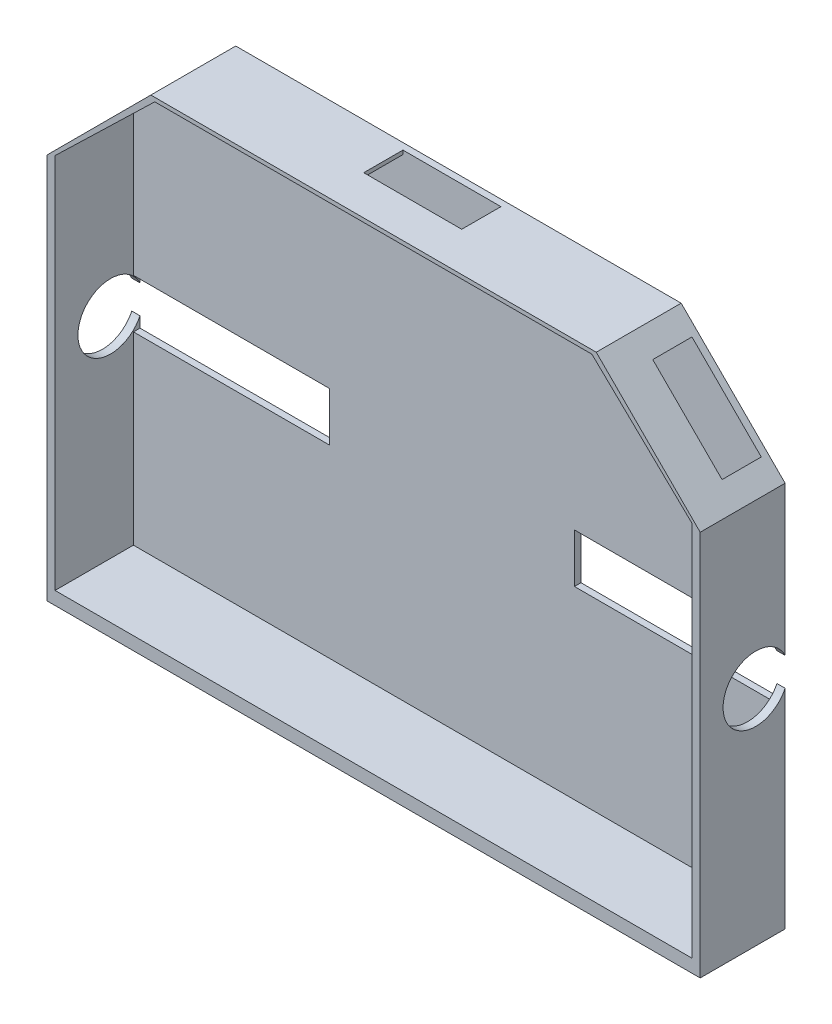
ISO-10303-21;
HEADER;
FILE_DESCRIPTION(('STEP AP214'),'2;1');
FILE_NAME('part.step','',(''),(''),'','','');
FILE_SCHEMA(('AUTOMOTIVE_DESIGN { 1 0 10303 214 1 1 1 1 }'));
ENDSEC;
DATA;
#1=APPLICATION_CONTEXT('core data for automotive mechanical design processes');
#2=APPLICATION_PROTOCOL_DEFINITION('international standard','automotive_design',2000,#1);
#3=PRODUCT_CONTEXT('',#1,'mechanical');
#4=PRODUCT('Part','Part','',(#3));
#5=PRODUCT_RELATED_PRODUCT_CATEGORY('part','',(#4));
#6=PRODUCT_DEFINITION_FORMATION('','',#4);
#7=PRODUCT_DEFINITION_CONTEXT('part definition',#1,'design');
#8=PRODUCT_DEFINITION('design','',#6,#7);
#9=PRODUCT_DEFINITION_SHAPE('','',#8);
#10=(LENGTH_UNIT() NAMED_UNIT(*) SI_UNIT(.MILLI.,.METRE.));
#11=(NAMED_UNIT(*) PLANE_ANGLE_UNIT() SI_UNIT($,.RADIAN.));
#12=(NAMED_UNIT(*) SI_UNIT($,.STERADIAN.) SOLID_ANGLE_UNIT());
#13=UNCERTAINTY_MEASURE_WITH_UNIT(LENGTH_MEASURE(1.E-05),#10,'distance_accuracy_value','');
#14=(GEOMETRIC_REPRESENTATION_CONTEXT(3) GLOBAL_UNCERTAINTY_ASSIGNED_CONTEXT((#13)) GLOBAL_UNIT_ASSIGNED_CONTEXT((#10,
#11,#12)) REPRESENTATION_CONTEXT('',''));
#15=CARTESIAN_POINT('',(0.,0.,0.));
#16=DIRECTION('',(0.,0.,1.));
#17=DIRECTION('',(1.,0.,0.));
#18=AXIS2_PLACEMENT_3D('',#15,#16,#17);
#19=CARTESIAN_POINT('',(200.,-0.01000000000001,52.));
#20=DIRECTION('',(0.,0.,-1.));
#21=DIRECTION('',(-1.,0.,0.));
#22=AXIS2_PLACEMENT_3D('',#19,#20,#21);
#23=PLANE('',#22);
#24=DIRECTION('',(0.,1.,0.));
#25=VECTOR('',#24,1.);
#26=CARTESIAN_POINT('',(2.49999999999999,65.,52.));
#27=LINE('',#26,#25);
#28=CARTESIAN_POINT('',(2.50000000000001,60.5483624870029,52.));
#29=VERTEX_POINT('',#28);
#30=CARTESIAN_POINT('',(2.50000000000001,63.8212959030645,52.));
#31=VERTEX_POINT('',#30);
#32=EDGE_CURVE('E371',#29,#31,#27,.T.);
#33=ORIENTED_EDGE('',*,*,#32,.F.);
#34=DIRECTION('',(1.,0.,0.));
#35=VECTOR('',#34,1.);
#36=CARTESIAN_POINT('',(62.5,60.5483624870029,52.));
#37=LINE('',#36,#35);
#38=CARTESIAN_POINT('',(62.5,60.5483624870029,52.));
#39=VERTEX_POINT('',#38);
#40=EDGE_CURVE('E521',#29,#39,#37,.T.);
#41=ORIENTED_EDGE('',*,*,#40,.T.);
#42=DIRECTION('',(0.,1.,0.));
#43=VECTOR('',#42,1.);
#44=CARTESIAN_POINT('',(62.5,75.5483624870029,52.));
#45=LINE('',#44,#43);
#46=CARTESIAN_POINT('',(62.5,75.5483624870029,52.));
#47=VERTEX_POINT('',#46);
#48=EDGE_CURVE('E524',#39,#47,#45,.T.);
#49=ORIENTED_EDGE('',*,*,#48,.T.);
#50=DIRECTION('',(-1.,0.,0.));
#51=VECTOR('',#50,1.);
#52=CARTESIAN_POINT('',(2.50000000000002,75.5483624870029,52.));
#53=LINE('',#52,#51);
#54=CARTESIAN_POINT('',(2.50000000000002,75.5483624870029,52.));
#55=VERTEX_POINT('',#54);
#56=EDGE_CURVE('E296',#47,#55,#53,.T.);
#57=ORIENTED_EDGE('',*,*,#56,.T.);
#58=CARTESIAN_POINT('',(2.49999999999999,72.5390937901459,52.));
#59=VERTEX_POINT('',#58);
#60=EDGE_CURVE('E373',#59,#55,#27,.T.);
#61=ORIENTED_EDGE('',*,*,#60,.F.);
#62=DIRECTION('',(1.,0.,0.));
#63=VECTOR('',#62,1.);
#64=CARTESIAN_POINT('',(0.,72.5390937901459,52.));
#65=LINE('',#64,#63);
#66=CARTESIAN_POINT('',(0.,72.5390937901459,52.));
#67=VERTEX_POINT('',#66);
#68=EDGE_CURVE('E390',#59,#67,#65,.F.);
#69=ORIENTED_EDGE('',*,*,#68,.T.);
#70=DIRECTION('',(0.,-1.,0.));
#71=VECTOR('',#70,1.);
#72=CARTESIAN_POINT('',(0.,0.,52.));
#73=LINE('',#72,#71);
#74=CARTESIAN_POINT('',(0.,118.180194846605,52.));
#75=VERTEX_POINT('',#74);
#76=EDGE_CURVE('E379',#75,#67,#73,.T.);
#77=ORIENTED_EDGE('',*,*,#76,.F.);
#78=DIRECTION('',(-0.707106781186551,-0.707106781186544,0.));
#79=VECTOR('',#78,1.);
#80=CARTESIAN_POINT('',(-59.0900974233027,59.0900974233033,52.));
#81=LINE('',#80,#79);
#82=CARTESIAN_POINT('',(31.819805153395,150.,52.));
#83=VERTEX_POINT('',#82);
#84=EDGE_CURVE('E367',#83,#75,#81,.T.);
#85=ORIENTED_EDGE('',*,*,#84,.F.);
#86=DIRECTION('',(-1.,0.,0.));
#87=VECTOR('',#86,1.);
#88=CARTESIAN_POINT('',(0.,150.,52.));
#89=LINE('',#88,#87);
#90=CARTESIAN_POINT('',(168.180194846606,150.,52.));
#91=VERTEX_POINT('',#90);
#92=EDGE_CURVE('E380',#91,#83,#89,.T.);
#93=ORIENTED_EDGE('',*,*,#92,.F.);
#94=DIRECTION('',(0.707106781186543,-0.707106781186552,0.));
#95=VECTOR('',#94,1.);
#96=CARTESIAN_POINT('',(159.090097423304,159.090097423302,52.));
#97=LINE('',#96,#95);
#98=CARTESIAN_POINT('',(200.,118.180194846605,52.));
#99=VERTEX_POINT('',#98);
#100=EDGE_CURVE('E402',#91,#99,#97,.T.);
#101=ORIENTED_EDGE('',*,*,#100,.T.);
#102=DIRECTION('',(0.,-1.,0.));
#103=VECTOR('',#102,1.);
#104=CARTESIAN_POINT('',(200.,0.,52.));
#105=LINE('',#104,#103);
#106=CARTESIAN_POINT('',(200.,72.5390937901459,52.));
#107=VERTEX_POINT('',#106);
#108=EDGE_CURVE('E386',#99,#107,#105,.T.);
#109=ORIENTED_EDGE('',*,*,#108,.T.);
#110=DIRECTION('',(1.,0.,0.));
#111=VECTOR('',#110,1.);
#112=CARTESIAN_POINT('',(0.,72.5390937901459,52.));
#113=LINE('',#112,#111);
#114=CARTESIAN_POINT('',(197.5,72.5390937901459,52.));
#115=VERTEX_POINT('',#114);
#116=EDGE_CURVE('E396',#107,#115,#113,.F.);
#117=ORIENTED_EDGE('',*,*,#116,.T.);
#118=DIRECTION('',(0.,-1.,0.));
#119=VECTOR('',#118,1.);
#120=CARTESIAN_POINT('',(197.5,67.5,52.));
#121=LINE('',#120,#119);
#122=CARTESIAN_POINT('',(197.5,75.5483624870029,52.));
#123=VERTEX_POINT('',#122);
#124=EDGE_CURVE('E375',#123,#115,#121,.T.);
#125=ORIENTED_EDGE('',*,*,#124,.F.);
#126=DIRECTION('',(-1.,0.,0.));
#127=VECTOR('',#126,1.);
#128=CARTESIAN_POINT('',(197.5,75.5483624870029,52.));
#129=LINE('',#128,#127);
#130=CARTESIAN_POINT('',(137.5,75.5483624870029,52.));
#131=VERTEX_POINT('',#130);
#132=EDGE_CURVE('E516',#123,#131,#129,.T.);
#133=ORIENTED_EDGE('',*,*,#132,.T.);
#134=DIRECTION('',(0.,-1.,0.));
#135=VECTOR('',#134,1.);
#136=CARTESIAN_POINT('',(137.5,75.5483624870029,52.));
#137=LINE('',#136,#135);
#138=CARTESIAN_POINT('',(137.5,60.5483624870029,52.));
#139=VERTEX_POINT('',#138);
#140=EDGE_CURVE('E518',#131,#139,#137,.T.);
#141=ORIENTED_EDGE('',*,*,#140,.T.);
#142=DIRECTION('',(1.,0.,0.));
#143=VECTOR('',#142,1.);
#144=CARTESIAN_POINT('',(137.5,60.5483624870029,52.));
#145=LINE('',#144,#143);
#146=CARTESIAN_POINT('',(197.5,60.5483624870029,52.));
#147=VERTEX_POINT('',#146);
#148=EDGE_CURVE('E437',#139,#147,#145,.T.);
#149=ORIENTED_EDGE('',*,*,#148,.T.);
#150=CARTESIAN_POINT('',(197.5,63.8212959030645,52.));
#151=VERTEX_POINT('',#150);
#152=EDGE_CURVE('E374',#151,#147,#121,.T.);
#153=ORIENTED_EDGE('',*,*,#152,.F.);
#154=DIRECTION('',(1.,0.,0.));
#155=VECTOR('',#154,1.);
#156=CARTESIAN_POINT('',(0.,63.8212959030645,52.));
#157=LINE('',#156,#155);
#158=CARTESIAN_POINT('',(200.,63.8212959030645,52.));
#159=VERTEX_POINT('',#158);
#160=EDGE_CURVE('E399',#151,#159,#157,.T.);
#161=ORIENTED_EDGE('',*,*,#160,.T.);
#162=CARTESIAN_POINT('',(200.,0.,52.));
#163=VERTEX_POINT('',#162);
#164=EDGE_CURVE('E387',#159,#163,#105,.T.);
#165=ORIENTED_EDGE('',*,*,#164,.T.);
#166=DIRECTION('',(-1.,0.,0.));
#167=VECTOR('',#166,1.);
#168=CARTESIAN_POINT('',(0.,0.,52.));
#169=LINE('',#168,#167);
#170=CARTESIAN_POINT('',(0.,0.,52.));
#171=VERTEX_POINT('',#170);
#172=EDGE_CURVE('E383',#163,#171,#169,.T.);
#173=ORIENTED_EDGE('',*,*,#172,.T.);
#174=CARTESIAN_POINT('',(0.,63.8212959030645,52.));
#175=VERTEX_POINT('',#174);
#176=EDGE_CURVE('E377',#175,#171,#73,.T.);
#177=ORIENTED_EDGE('',*,*,#176,.F.);
#178=DIRECTION('',(1.,0.,0.));
#179=VECTOR('',#178,1.);
#180=CARTESIAN_POINT('',(0.,63.8212959030645,52.));
#181=LINE('',#180,#179);
#182=EDGE_CURVE('E393',#175,#31,#181,.T.);
#183=ORIENTED_EDGE('',*,*,#182,.T.);
#184=EDGE_LOOP('',(#33,#41,#49,#57,#61,#69,#77,#85,#93,#101,#109,#117,#125,#133,#141,#149,#153,
#161,#165,#173,#177,#183));
#185=FACE_BOUND('',#184,.T.);
#186=ADVANCED_FACE('F39',(#185),#23,.T.);
#187=CARTESIAN_POINT('',(0.,0.,52.));
#188=DIRECTION('',(0.,1.,0.));
#189=DIRECTION('',(0.,0.,1.));
#190=AXIS2_PLACEMENT_3D('',#187,#188,#189);
#191=PLANE('',#190);
#192=ORIENTED_EDGE('',*,*,#172,.F.);
#193=DIRECTION('',(0.,0.,-1.));
#194=VECTOR('',#193,1.);
#195=CARTESIAN_POINT('',(200.,0.,78.));
#196=LINE('',#195,#194);
#197=CARTESIAN_POINT('',(200.,0.,78.));
#198=VERTEX_POINT('',#197);
#199=EDGE_CURVE('E406',#198,#163,#196,.T.);
#200=ORIENTED_EDGE('',*,*,#199,.F.);
#201=DIRECTION('',(1.,0.,0.));
#202=VECTOR('',#201,1.);
#203=CARTESIAN_POINT('',(0.,0.,78.));
#204=LINE('',#203,#202);
#205=CARTESIAN_POINT('',(0.,0.,78.));
#206=VERTEX_POINT('',#205);
#207=EDGE_CURVE('E568',#206,#198,#204,.T.);
#208=ORIENTED_EDGE('',*,*,#207,.F.);
#209=DIRECTION('',(0.,0.,-1.));
#210=VECTOR('',#209,1.);
#211=CARTESIAN_POINT('',(0.,0.,78.));
#212=LINE('',#211,#210);
#213=EDGE_CURVE('E403',#206,#171,#212,.T.);
#214=ORIENTED_EDGE('',*,*,#213,.T.);
#215=EDGE_LOOP('',(#192,#200,#208,#214));
#216=FACE_BOUND('',#215,.T.);
#217=ADVANCED_FACE('F585',(#216),#191,.F.);
#218=CARTESIAN_POINT('',(0.,150.,52.));
#219=DIRECTION('',(0.,1.,0.));
#220=DIRECTION('',(0.,0.,1.));
#221=AXIS2_PLACEMENT_3D('',#218,#219,#220);
#222=PLANE('',#221);
#223=DIRECTION('',(0.,0.,1.));
#224=VECTOR('',#223,1.);
#225=CARTESIAN_POINT('',(85.0001948466056,150.,54.));
#226=LINE('',#225,#224);
#227=CARTESIAN_POINT('',(85.0001948466056,150.,54.));
#228=VERTEX_POINT('',#227);
#229=CARTESIAN_POINT('',(85.0001948466056,150.,66.));
#230=VERTEX_POINT('',#229);
#231=EDGE_CURVE('E474',#228,#230,#226,.T.);
#232=ORIENTED_EDGE('',*,*,#231,.F.);
#233=DIRECTION('',(-1.,0.,0.));
#234=VECTOR('',#233,1.);
#235=CARTESIAN_POINT('',(85.0001948466056,150.,54.));
#236=LINE('',#235,#234);
#237=CARTESIAN_POINT('',(115.000194846606,150.,54.));
#238=VERTEX_POINT('',#237);
#239=EDGE_CURVE('E460',#238,#228,#236,.T.);
#240=ORIENTED_EDGE('',*,*,#239,.F.);
#241=DIRECTION('',(0.,0.,-1.));
#242=VECTOR('',#241,1.);
#243=CARTESIAN_POINT('',(115.000194846606,150.,54.));
#244=LINE('',#243,#242);
#245=CARTESIAN_POINT('',(115.000194846606,150.,66.));
#246=VERTEX_POINT('',#245);
#247=EDGE_CURVE('E468',#246,#238,#244,.T.);
#248=ORIENTED_EDGE('',*,*,#247,.F.);
#249=DIRECTION('',(1.,0.,0.));
#250=VECTOR('',#249,1.);
#251=CARTESIAN_POINT('',(85.0001948466056,150.,66.));
#252=LINE('',#251,#250);
#253=EDGE_CURVE('E471',#230,#246,#252,.T.);
#254=ORIENTED_EDGE('',*,*,#253,.F.);
#255=EDGE_LOOP('',(#232,#240,#248,#254));
#256=FACE_BOUND('',#255,.T.);
#257=DIRECTION('',(0.,0.,-1.));
#258=VECTOR('',#257,1.);
#259=CARTESIAN_POINT('',(168.180194846606,150.,78.));
#260=LINE('',#259,#258);
#261=CARTESIAN_POINT('',(168.180194846606,150.,78.));
#262=VERTEX_POINT('',#261);
#263=EDGE_CURVE('E449',#262,#91,#260,.T.);
#264=ORIENTED_EDGE('',*,*,#263,.T.);
#265=ORIENTED_EDGE('',*,*,#92,.T.);
#266=DIRECTION('',(0.,0.,-1.));
#267=VECTOR('',#266,1.);
#268=CARTESIAN_POINT('',(31.819805153395,150.,78.));
#269=LINE('',#268,#267);
#270=CARTESIAN_POINT('',(31.819805153395,150.,78.));
#271=VERTEX_POINT('',#270);
#272=EDGE_CURVE('E562',#271,#83,#269,.T.);
#273=ORIENTED_EDGE('',*,*,#272,.F.);
#274=DIRECTION('',(-1.,0.,0.));
#275=VECTOR('',#274,1.);
#276=CARTESIAN_POINT('',(0.,150.,78.));
#277=LINE('',#276,#275);
#278=EDGE_CURVE('E452',#262,#271,#277,.T.);
#279=ORIENTED_EDGE('',*,*,#278,.F.);
#280=EDGE_LOOP('',(#264,#265,#273,#279));
#281=FACE_BOUND('',#280,.T.);
#282=ADVANCED_FACE('F609',(#256,#281),#222,.T.);
#283=CARTESIAN_POINT('',(85.0001948466056,140.,54.));
#284=DIRECTION('',(-1.,0.,0.));
#285=DIRECTION('',(0.,0.,1.));
#286=AXIS2_PLACEMENT_3D('',#283,#284,#285);
#287=PLANE('',#286);
#288=DIRECTION('',(0.,1.,0.));
#289=VECTOR('',#288,1.);
#290=CARTESIAN_POINT('',(85.0001948466056,140.,66.));
#291=LINE('',#290,#289);
#292=CARTESIAN_POINT('',(85.0001948466056,148.80480350133,66.));
#293=VERTEX_POINT('',#292);
#294=EDGE_CURVE('E458',#293,#230,#291,.T.);
#295=ORIENTED_EDGE('',*,*,#294,.F.);
#296=DIRECTION('',(0.,0.,-1.));
#297=VECTOR('',#296,1.);
#298=CARTESIAN_POINT('',(85.0001948466056,148.80480350133,54.));
#299=LINE('',#298,#297);
#300=CARTESIAN_POINT('',(85.0001948466056,148.80480350133,54.));
#301=VERTEX_POINT('',#300);
#302=EDGE_CURVE('E477',#293,#301,#299,.T.);
#303=ORIENTED_EDGE('',*,*,#302,.T.);
#304=DIRECTION('',(0.,1.,0.));
#305=VECTOR('',#304,1.);
#306=CARTESIAN_POINT('',(85.0001948466056,140.,54.));
#307=LINE('',#306,#305);
#308=EDGE_CURVE('E369',#301,#228,#307,.T.);
#309=ORIENTED_EDGE('',*,*,#308,.T.);
#310=ORIENTED_EDGE('',*,*,#231,.T.);
#311=EDGE_LOOP('',(#295,#303,#309,#310));
#312=FACE_BOUND('',#311,.T.);
#313=ADVANCED_FACE('F603',(#312),#287,.F.);
#314=CARTESIAN_POINT('',(85.0001948466056,140.,54.));
#315=DIRECTION('',(0.,0.,-1.));
#316=DIRECTION('',(-1.,0.,0.));
#317=AXIS2_PLACEMENT_3D('',#314,#315,#316);
#318=PLANE('',#317);
#319=ORIENTED_EDGE('',*,*,#308,.F.);
#320=DIRECTION('',(1.,0.,0.));
#321=VECTOR('',#320,1.);
#322=CARTESIAN_POINT('',(33.0324844205381,148.80480350133,54.));
#323=LINE('',#322,#321);
#324=CARTESIAN_POINT('',(33.0324844205381,148.80480350133,54.));
#325=VERTEX_POINT('',#324);
#326=EDGE_CURVE('E508',#325,#301,#323,.T.);
#327=ORIENTED_EDGE('',*,*,#326,.F.);
#328=DIRECTION('',(0.718978108778846,0.695032718004552,0.));
#329=VECTOR('',#328,1.);
#330=CARTESIAN_POINT('',(2.50000000000001,119.289196036895,54.));
#331=LINE('',#330,#329);
#332=CARTESIAN_POINT('',(27.6304860576106,143.582717377986,54.));
#333=VERTEX_POINT('',#332);
#334=EDGE_CURVE('E11',#333,#325,#331,.T.);
#335=ORIENTED_EDGE('',*,*,#334,.F.);
#336=DIRECTION('',(-0.707106781186549,0.707106781186546,0.));
#337=VECTOR('',#336,1.);
#338=CARTESIAN_POINT('',(45.6083873865321,125.604816049065,54.));
#339=LINE('',#338,#337);
#340=CARTESIAN_POINT('',(26.5165042944953,144.696699141102,54.));
#341=VERTEX_POINT('',#340);
#342=EDGE_CURVE('E54',#333,#341,#339,.T.);
#343=ORIENTED_EDGE('',*,*,#342,.T.);
#344=DIRECTION('',(-0.707106781186547,-0.707106781186548,0.));
#345=VECTOR('',#344,1.);
#346=CARTESIAN_POINT('',(26.5165042944953,144.696699141102,54.));
#347=LINE('',#346,#345);
#348=CARTESIAN_POINT('',(5.30330085889887,123.483495705505,54.));
#349=VERTEX_POINT('',#348);
#350=EDGE_CURVE('E360',#341,#349,#347,.T.);
#351=ORIENTED_EDGE('',*,*,#350,.T.);
#352=DIRECTION('',(-0.707106781186549,0.707106781186546,0.));
#353=VECTOR('',#352,1.);
#354=CARTESIAN_POINT('',(24.3951839509357,104.391612613468,54.));
#355=LINE('',#354,#353);
#356=CARTESIAN_POINT('',(6.05805026238965,122.728746302014,54.));
#357=VERTEX_POINT('',#356);
#358=EDGE_CURVE('E62',#357,#349,#355,.T.);
#359=ORIENTED_EDGE('',*,*,#358,.F.);
#360=DIRECTION('',(0.718978108778846,0.695032718004551,0.));
#361=VECTOR('',#360,1.);
#362=CARTESIAN_POINT('',(2.5,119.289196036895,54.));
#363=LINE('',#362,#361);
#364=CARTESIAN_POINT('',(2.5,119.289196036895,54.));
#365=VERTEX_POINT('',#364);
#366=EDGE_CURVE('E509',#365,#357,#363,.T.);
#367=ORIENTED_EDGE('',*,*,#366,.F.);
#368=DIRECTION('',(0.,1.,0.));
#369=VECTOR('',#368,1.);
#370=CARTESIAN_POINT('',(2.50000000000002,75.5483624870029,54.));
#371=LINE('',#370,#369);
#372=CARTESIAN_POINT('',(2.50000000000002,75.5483624870029,54.));
#373=VERTEX_POINT('',#372);
#374=EDGE_CURVE('E512',#373,#365,#371,.T.);
#375=ORIENTED_EDGE('',*,*,#374,.F.);
#376=DIRECTION('',(-1.,0.,0.));
#377=VECTOR('',#376,1.);
#378=CARTESIAN_POINT('',(2.50000000000002,75.5483624870029,54.));
#379=LINE('',#378,#377);
#380=CARTESIAN_POINT('',(62.5,75.5483624870029,54.));
#381=VERTEX_POINT('',#380);
#382=EDGE_CURVE('E598',#381,#373,#379,.T.);
#383=ORIENTED_EDGE('',*,*,#382,.F.);
#384=DIRECTION('',(0.,1.,0.));
#385=VECTOR('',#384,1.);
#386=CARTESIAN_POINT('',(62.5,75.5483624870029,54.));
#387=LINE('',#386,#385);
#388=CARTESIAN_POINT('',(62.5,60.5483624870029,54.));
#389=VERTEX_POINT('',#388);
#390=EDGE_CURVE('E996',#389,#381,#387,.T.);
#391=ORIENTED_EDGE('',*,*,#390,.F.);
#392=DIRECTION('',(1.,0.,0.));
#393=VECTOR('',#392,1.);
#394=CARTESIAN_POINT('',(62.5,60.5483624870029,54.));
#395=LINE('',#394,#393);
#396=CARTESIAN_POINT('',(2.50000000000001,60.5483624870029,54.));
#397=VERTEX_POINT('',#396);
#398=EDGE_CURVE('E993',#397,#389,#395,.T.);
#399=ORIENTED_EDGE('',*,*,#398,.F.);
#400=DIRECTION('',(0.,1.,0.));
#401=VECTOR('',#400,1.);
#402=CARTESIAN_POINT('',(2.50000000000002,4.,54.));
#403=LINE('',#402,#401);
#404=CARTESIAN_POINT('',(2.50000000000002,4.,54.));
#405=VERTEX_POINT('',#404);
#406=EDGE_CURVE('E991',#405,#397,#403,.T.);
#407=ORIENTED_EDGE('',*,*,#406,.F.);
#408=DIRECTION('',(-1.,0.,0.));
#409=VECTOR('',#408,1.);
#410=CARTESIAN_POINT('',(197.5,4.,54.));
#411=LINE('',#410,#409);
#412=CARTESIAN_POINT('',(197.5,4.,54.));
#413=VERTEX_POINT('',#412);
#414=EDGE_CURVE('E487',#413,#405,#411,.T.);
#415=ORIENTED_EDGE('',*,*,#414,.F.);
#416=DIRECTION('',(0.,-1.,0.));
#417=VECTOR('',#416,1.);
#418=CARTESIAN_POINT('',(197.5,60.5483624870029,54.));
#419=LINE('',#418,#417);
#420=CARTESIAN_POINT('',(197.5,60.5483624870029,54.));
#421=VERTEX_POINT('',#420);
#422=EDGE_CURVE('E987',#421,#413,#419,.T.);
#423=ORIENTED_EDGE('',*,*,#422,.F.);
#424=DIRECTION('',(1.,0.,0.));
#425=VECTOR('',#424,1.);
#426=CARTESIAN_POINT('',(137.5,60.5483624870029,54.));
#427=LINE('',#426,#425);
#428=CARTESIAN_POINT('',(137.5,60.5483624870029,54.));
#429=VERTEX_POINT('',#428);
#430=EDGE_CURVE('E984',#429,#421,#427,.T.);
#431=ORIENTED_EDGE('',*,*,#430,.F.);
#432=DIRECTION('',(0.,-1.,0.));
#433=VECTOR('',#432,1.);
#434=CARTESIAN_POINT('',(137.5,75.5483624870029,54.));
#435=LINE('',#434,#433);
#436=CARTESIAN_POINT('',(137.5,75.5483624870029,54.));
#437=VERTEX_POINT('',#436);
#438=EDGE_CURVE('E981',#437,#429,#435,.T.);
#439=ORIENTED_EDGE('',*,*,#438,.F.);
#440=DIRECTION('',(-1.,0.,0.));
#441=VECTOR('',#440,1.);
#442=CARTESIAN_POINT('',(197.5,75.5483624870029,54.));
#443=LINE('',#442,#441);
#444=CARTESIAN_POINT('',(197.5,75.5483624870029,54.));
#445=VERTEX_POINT('',#444);
#446=EDGE_CURVE('E281',#445,#437,#443,.T.);
#447=ORIENTED_EDGE('',*,*,#446,.F.);
#448=DIRECTION('',(0.,-1.,0.));
#449=VECTOR('',#448,1.);
#450=CARTESIAN_POINT('',(197.5,119.289196036895,54.));
#451=LINE('',#450,#449);
#452=CARTESIAN_POINT('',(197.5,119.289196036895,54.));
#453=VERTEX_POINT('',#452);
#454=EDGE_CURVE('E273',#453,#445,#451,.T.);
#455=ORIENTED_EDGE('',*,*,#454,.F.);
#456=DIRECTION('',(0.720253643823131,-0.693710810467519,0.));
#457=VECTOR('',#456,1.);
#458=CARTESIAN_POINT('',(166.855063370592,148.80480350133,54.));
#459=LINE('',#458,#457);
#460=CARTESIAN_POINT('',(193.935520523403,122.722317087806,54.));
#461=VERTEX_POINT('',#460);
#462=EDGE_CURVE('E277',#461,#453,#459,.T.);
#463=ORIENTED_EDGE('',*,*,#462,.F.);
#464=DIRECTION('',(0.707106781186551,0.707106781186544,0.));
#465=VECTOR('',#464,1.);
#466=CARTESIAN_POINT('',(175.604816049064,104.391612613468,54.));
#467=LINE('',#466,#465);
#468=CARTESIAN_POINT('',(194.696699141101,123.483495705504,54.));
#469=VERTEX_POINT('',#468);
#470=EDGE_CURVE('E336',#461,#469,#467,.T.);
#471=ORIENTED_EDGE('',*,*,#470,.T.);
#472=DIRECTION('',(-0.707106781186544,0.707106781186551,0.));
#473=VECTOR('',#472,1.);
#474=CARTESIAN_POINT('',(173.483495705505,144.696699141101,54.));
#475=LINE('',#474,#473);
#476=CARTESIAN_POINT('',(173.483495705505,144.696699141101,54.));
#477=VERTEX_POINT('',#476);
#478=EDGE_CURVE('E343',#469,#477,#475,.T.);
#479=ORIENTED_EDGE('',*,*,#478,.T.);
#480=DIRECTION('',(0.707106781186551,0.707106781186544,0.));
#481=VECTOR('',#480,1.);
#482=CARTESIAN_POINT('',(154.391612613468,125.604816049064,54.));
#483=LINE('',#482,#481);
#484=CARTESIAN_POINT('',(172.324104443902,143.537307879499,54.));
#485=VERTEX_POINT('',#484);
#486=EDGE_CURVE('E338',#485,#477,#483,.T.);
#487=ORIENTED_EDGE('',*,*,#486,.F.);
#488=CARTESIAN_POINT('',(166.855063370592,148.80480350133,54.));
#489=VERTEX_POINT('',#488);
#490=EDGE_CURVE('E285',#489,#485,#459,.T.);
#491=ORIENTED_EDGE('',*,*,#490,.F.);
#492=CARTESIAN_POINT('',(115.000194846606,148.80480350133,54.));
#493=VERTEX_POINT('',#492);
#494=EDGE_CURVE('E506',#493,#489,#323,.T.);
#495=ORIENTED_EDGE('',*,*,#494,.F.);
#496=DIRECTION('',(0.,1.,0.));
#497=VECTOR('',#496,1.);
#498=CARTESIAN_POINT('',(115.000194846606,140.,54.));
#499=LINE('',#498,#497);
#500=EDGE_CURVE('E463',#493,#238,#499,.T.);
#501=ORIENTED_EDGE('',*,*,#500,.T.);
#502=ORIENTED_EDGE('',*,*,#239,.T.);
#503=EDGE_LOOP('',(#319,#327,#335,#343,#351,#359,#367,#375,#383,#391,#399,#407,#415,#423,#431,
#439,#447,#455,#463,#471,#479,#487,#491,#495,#501,#502));
#504=FACE_BOUND('',#503,.T.);
#505=ADVANCED_FACE('F276',(#504),#318,.F.);
#506=CARTESIAN_POINT('',(115.000194846606,140.,54.));
#507=DIRECTION('',(1.,0.,0.));
#508=DIRECTION('',(0.,0.,-1.));
#509=AXIS2_PLACEMENT_3D('',#506,#507,#508);
#510=PLANE('',#509);
#511=ORIENTED_EDGE('',*,*,#500,.F.);
#512=DIRECTION('',(0.,0.,1.));
#513=VECTOR('',#512,1.);
#514=CARTESIAN_POINT('',(115.000194846606,148.80480350133,54.));
#515=LINE('',#514,#513);
#516=CARTESIAN_POINT('',(115.000194846606,148.80480350133,66.));
#517=VERTEX_POINT('',#516);
#518=EDGE_CURVE('E315',#493,#517,#515,.T.);
#519=ORIENTED_EDGE('',*,*,#518,.T.);
#520=DIRECTION('',(0.,1.,0.));
#521=VECTOR('',#520,1.);
#522=CARTESIAN_POINT('',(115.000194846606,140.,66.));
#523=LINE('',#522,#521);
#524=EDGE_CURVE('E461',#517,#246,#523,.T.);
#525=ORIENTED_EDGE('',*,*,#524,.T.);
#526=ORIENTED_EDGE('',*,*,#247,.T.);
#527=EDGE_LOOP('',(#511,#519,#525,#526));
#528=FACE_BOUND('',#527,.T.);
#529=ADVANCED_FACE('F615',(#528),#510,.F.);
#530=CARTESIAN_POINT('',(85.0001948466056,140.,66.));
#531=DIRECTION('',(0.,0.,1.));
#532=DIRECTION('',(1.,0.,0.));
#533=AXIS2_PLACEMENT_3D('',#530,#531,#532);
#534=PLANE('',#533);
#535=ORIENTED_EDGE('',*,*,#524,.F.);
#536=DIRECTION('',(-1.,0.,0.));
#537=VECTOR('',#536,1.);
#538=CARTESIAN_POINT('',(85.0001948466056,148.80480350133,66.));
#539=LINE('',#538,#537);
#540=EDGE_CURVE('E558',#517,#293,#539,.T.);
#541=ORIENTED_EDGE('',*,*,#540,.T.);
#542=ORIENTED_EDGE('',*,*,#294,.T.);
#543=ORIENTED_EDGE('',*,*,#253,.T.);
#544=EDGE_LOOP('',(#535,#541,#542,#543));
#545=FACE_BOUND('',#544,.T.);
#546=ADVANCED_FACE('F613',(#545),#534,.F.);
#547=CARTESIAN_POINT('',(33.0324844205381,148.80480350133,52.));
#548=DIRECTION('',(0.,1.,0.));
#549=DIRECTION('',(0.,0.,1.));
#550=AXIS2_PLACEMENT_3D('',#547,#548,#549);
#551=PLANE('',#550);
#552=DIRECTION('',(0.,0.,1.));
#553=VECTOR('',#552,1.);
#554=CARTESIAN_POINT('',(33.0324844205381,148.80480350133,52.));
#555=LINE('',#554,#553);
#556=CARTESIAN_POINT('',(33.0324844205381,148.80480350133,78.));
#557=VERTEX_POINT('',#556);
#558=EDGE_CURVE('E308',#325,#557,#555,.T.);
#559=ORIENTED_EDGE('',*,*,#558,.F.);
#560=ORIENTED_EDGE('',*,*,#326,.T.);
#561=ORIENTED_EDGE('',*,*,#302,.F.);
#562=ORIENTED_EDGE('',*,*,#540,.F.);
#563=ORIENTED_EDGE('',*,*,#518,.F.);
#564=ORIENTED_EDGE('',*,*,#494,.T.);
#565=DIRECTION('',(0.,0.,1.));
#566=VECTOR('',#565,1.);
#567=CARTESIAN_POINT('',(166.855063370592,148.80480350133,52.));
#568=LINE('',#567,#566);
#569=CARTESIAN_POINT('',(166.855063370592,148.80480350133,78.));
#570=VERTEX_POINT('',#569);
#571=EDGE_CURVE('E304',#489,#570,#568,.T.);
#572=ORIENTED_EDGE('',*,*,#571,.T.);
#573=DIRECTION('',(-1.,0.,0.));
#574=VECTOR('',#573,1.);
#575=CARTESIAN_POINT('',(33.0324844205381,148.80480350133,78.));
#576=LINE('',#575,#574);
#577=EDGE_CURVE('E319',#570,#557,#576,.T.);
#578=ORIENTED_EDGE('',*,*,#577,.T.);
#579=EDGE_LOOP('',(#559,#560,#561,#562,#563,#564,#572,#578));
#580=FACE_BOUND('',#579,.T.);
#581=ADVANCED_FACE('F504',(#580),#551,.F.);
#582=CARTESIAN_POINT('',(0.,0.,52.));
#583=DIRECTION('',(-1.,0.,0.));
#584=DIRECTION('',(0.,0.,1.));
#585=AXIS2_PLACEMENT_3D('',#582,#583,#584);
#586=PLANE('',#585);
#587=DIRECTION('',(0.,0.,-1.));
#588=VECTOR('',#587,1.);
#589=CARTESIAN_POINT('',(0.,118.180194846605,78.));
#590=LINE('',#589,#588);
#591=CARTESIAN_POINT('',(0.,118.180194846605,78.));
#592=VERTEX_POINT('',#591);
#593=EDGE_CURVE('E407',#592,#75,#590,.T.);
#594=ORIENTED_EDGE('',*,*,#593,.T.);
#595=ORIENTED_EDGE('',*,*,#76,.T.);
#596=CARTESIAN_POINT('',(0.,68.1801948466052,61.));
#597=DIRECTION('',(1.,0.,0.));
#598=DIRECTION('',(0.,0.,-1.));
#599=AXIS2_PLACEMENT_3D('',#596,#597,#598);
#600=CIRCLE('',#599,10.);
#601=EDGE_CURVE('E418',#67,#175,#600,.T.);
#602=ORIENTED_EDGE('',*,*,#601,.T.);
#603=ORIENTED_EDGE('',*,*,#176,.T.);
#604=ORIENTED_EDGE('',*,*,#213,.F.);
#605=DIRECTION('',(0.,-1.,0.));
#606=VECTOR('',#605,1.);
#607=CARTESIAN_POINT('',(0.,0.,78.));
#608=LINE('',#607,#606);
#609=EDGE_CURVE('E570',#592,#206,#608,.T.);
#610=ORIENTED_EDGE('',*,*,#609,.F.);
#611=EDGE_LOOP('',(#594,#595,#602,#603,#604,#610));
#612=FACE_BOUND('',#611,.T.);
#613=ADVANCED_FACE('F581',(#612),#586,.T.);
#614=CARTESIAN_POINT('',(2.49999999999999,65.,52.));
#615=DIRECTION('',(1.,0.,0.));
#616=DIRECTION('',(0.,1.,0.));
#617=AXIS2_PLACEMENT_3D('',#614,#615,#616);
#618=PLANE('',#617);
#619=DIRECTION('',(0.,0.,-1.));
#620=VECTOR('',#619,1.);
#621=CARTESIAN_POINT('',(2.50000000000002,75.5483624870029,54.));
#622=LINE('',#621,#620);
#623=EDGE_CURVE('E412',#373,#55,#622,.T.);
#624=ORIENTED_EDGE('',*,*,#623,.F.);
#625=ORIENTED_EDGE('',*,*,#374,.T.);
#626=DIRECTION('',(0.,0.,1.));
#627=VECTOR('',#626,1.);
#628=CARTESIAN_POINT('',(2.50000000000001,119.289196036895,52.));
#629=LINE('',#628,#627);
#630=CARTESIAN_POINT('',(2.50000000000001,119.289196036895,78.));
#631=VERTEX_POINT('',#630);
#632=EDGE_CURVE('E313',#365,#631,#629,.T.);
#633=ORIENTED_EDGE('',*,*,#632,.T.);
#634=DIRECTION('',(0.,-1.,0.));
#635=VECTOR('',#634,1.);
#636=CARTESIAN_POINT('',(2.50000000000001,119.289196036895,78.));
#637=LINE('',#636,#635);
#638=CARTESIAN_POINT('',(2.50000000000002,4.,78.));
#639=VERTEX_POINT('',#638);
#640=EDGE_CURVE('E328',#631,#639,#637,.T.);
#641=ORIENTED_EDGE('',*,*,#640,.T.);
#642=DIRECTION('',(0.,0.,1.));
#643=VECTOR('',#642,1.);
#644=CARTESIAN_POINT('',(2.50000000000002,4.,52.));
#645=LINE('',#644,#643);
#646=EDGE_CURVE('E306',#405,#639,#645,.T.);
#647=ORIENTED_EDGE('',*,*,#646,.F.);
#648=ORIENTED_EDGE('',*,*,#406,.T.);
#649=DIRECTION('',(0.,0.,-1.));
#650=VECTOR('',#649,1.);
#651=CARTESIAN_POINT('',(2.50000000000001,60.5483624870029,54.));
#652=LINE('',#651,#650);
#653=EDGE_CURVE('E534',#397,#29,#652,.T.);
#654=ORIENTED_EDGE('',*,*,#653,.T.);
#655=ORIENTED_EDGE('',*,*,#32,.T.);
#656=CARTESIAN_POINT('',(2.49999999999999,68.1801948466052,61.));
#657=DIRECTION('',(1.,0.,0.));
#658=DIRECTION('',(0.,1.,0.));
#659=AXIS2_PLACEMENT_3D('',#656,#657,#658);
#660=CIRCLE('',#659,10.);
#661=EDGE_CURVE('E415',#59,#31,#660,.T.);
#662=ORIENTED_EDGE('',*,*,#661,.F.);
#663=ORIENTED_EDGE('',*,*,#60,.T.);
#664=EDGE_LOOP('',(#624,#625,#633,#641,#647,#648,#654,#655,#662,#663));
#665=FACE_BOUND('',#664,.T.);
#666=ADVANCED_FACE('F492',(#665),#618,.T.);
#667=CARTESIAN_POINT('',(0.,68.1801948466052,61.));
#668=DIRECTION('',(1.,0.,0.));
#669=DIRECTION('',(0.,0.,-1.));
#670=AXIS2_PLACEMENT_3D('',#667,#668,#669);
#671=CYLINDRICAL_SURFACE('',#670,10.);
#672=ORIENTED_EDGE('',*,*,#68,.F.);
#673=ORIENTED_EDGE('',*,*,#661,.T.);
#674=ORIENTED_EDGE('',*,*,#182,.F.);
#675=ORIENTED_EDGE('',*,*,#601,.F.);
#676=EDGE_LOOP('',(#672,#673,#674,#675));
#677=FACE_BOUND('',#676,.T.);
#678=ADVANCED_FACE('F589',(#677),#671,.F.);
#679=CARTESIAN_POINT('',(197.5,67.5,52.));
#680=DIRECTION('',(-1.,0.,0.));
#681=DIRECTION('',(0.,-1.,0.));
#682=AXIS2_PLACEMENT_3D('',#679,#680,#681);
#683=PLANE('',#682);
#684=DIRECTION('',(0.,0.,-1.));
#685=VECTOR('',#684,1.);
#686=CARTESIAN_POINT('',(197.5,60.5483624870029,54.));
#687=LINE('',#686,#685);
#688=EDGE_CURVE('E537',#421,#147,#687,.T.);
#689=ORIENTED_EDGE('',*,*,#688,.F.);
#690=ORIENTED_EDGE('',*,*,#422,.T.);
#691=DIRECTION('',(0.,0.,1.));
#692=VECTOR('',#691,1.);
#693=CARTESIAN_POINT('',(197.5,4.,52.));
#694=LINE('',#693,#692);
#695=CARTESIAN_POINT('',(197.5,4.,78.));
#696=VERTEX_POINT('',#695);
#697=EDGE_CURVE('E303',#413,#696,#694,.T.);
#698=ORIENTED_EDGE('',*,*,#697,.T.);
#699=DIRECTION('',(0.,1.,0.));
#700=VECTOR('',#699,1.);
#701=CARTESIAN_POINT('',(197.5,119.289196036895,78.));
#702=LINE('',#701,#700);
#703=CARTESIAN_POINT('',(197.5,119.289196036895,78.));
#704=VERTEX_POINT('',#703);
#705=EDGE_CURVE('E301',#696,#704,#702,.T.);
#706=ORIENTED_EDGE('',*,*,#705,.T.);
#707=DIRECTION('',(0.,0.,1.));
#708=VECTOR('',#707,1.);
#709=CARTESIAN_POINT('',(197.5,119.289196036895,52.));
#710=LINE('',#709,#708);
#711=EDGE_CURVE('E292',#453,#704,#710,.T.);
#712=ORIENTED_EDGE('',*,*,#711,.F.);
#713=ORIENTED_EDGE('',*,*,#454,.T.);
#714=DIRECTION('',(0.,0.,-1.));
#715=VECTOR('',#714,1.);
#716=CARTESIAN_POINT('',(197.5,75.5483624870029,54.));
#717=LINE('',#716,#715);
#718=EDGE_CURVE('E511',#445,#123,#717,.T.);
#719=ORIENTED_EDGE('',*,*,#718,.T.);
#720=ORIENTED_EDGE('',*,*,#124,.T.);
#721=CARTESIAN_POINT('',(197.5,68.1801948466052,61.));
#722=DIRECTION('',(-1.,0.,0.));
#723=DIRECTION('',(0.,-1.,0.));
#724=AXIS2_PLACEMENT_3D('',#721,#722,#723);
#725=CIRCLE('',#724,10.);
#726=EDGE_CURVE('E366',#151,#115,#725,.T.);
#727=ORIENTED_EDGE('',*,*,#726,.F.);
#728=ORIENTED_EDGE('',*,*,#152,.T.);
#729=EDGE_LOOP('',(#689,#690,#698,#706,#712,#713,#719,#720,#727,#728));
#730=FACE_BOUND('',#729,.T.);
#731=ADVANCED_FACE('F299',(#730),#683,.T.);
#732=CARTESIAN_POINT('',(200.,0.,52.));
#733=DIRECTION('',(-1.,0.,0.));
#734=DIRECTION('',(0.,0.,1.));
#735=AXIS2_PLACEMENT_3D('',#732,#733,#734);
#736=PLANE('',#735);
#737=ORIENTED_EDGE('',*,*,#108,.F.);
#738=DIRECTION('',(0.,0.,-1.));
#739=VECTOR('',#738,1.);
#740=CARTESIAN_POINT('',(200.,118.180194846605,78.));
#741=LINE('',#740,#739);
#742=CARTESIAN_POINT('',(200.,118.180194846605,78.));
#743=VERTEX_POINT('',#742);
#744=EDGE_CURVE('E409',#743,#99,#741,.T.);
#745=ORIENTED_EDGE('',*,*,#744,.F.);
#746=DIRECTION('',(0.,1.,0.));
#747=VECTOR('',#746,1.);
#748=CARTESIAN_POINT('',(200.,0.,78.));
#749=LINE('',#748,#747);
#750=EDGE_CURVE('E444',#198,#743,#749,.T.);
#751=ORIENTED_EDGE('',*,*,#750,.F.);
#752=ORIENTED_EDGE('',*,*,#199,.T.);
#753=ORIENTED_EDGE('',*,*,#164,.F.);
#754=CARTESIAN_POINT('',(200.,68.1801948466052,61.));
#755=DIRECTION('',(1.,0.,0.));
#756=DIRECTION('',(0.,0.,-1.));
#757=AXIS2_PLACEMENT_3D('',#754,#755,#756);
#758=CIRCLE('',#757,10.);
#759=EDGE_CURVE('E47',#107,#159,#758,.T.);
#760=ORIENTED_EDGE('',*,*,#759,.F.);
#761=EDGE_LOOP('',(#737,#745,#751,#752,#753,#760));
#762=FACE_BOUND('',#761,.T.);
#763=ADVANCED_FACE('F41',(#762),#736,.F.);
#764=ORIENTED_EDGE('',*,*,#116,.F.);
#765=ORIENTED_EDGE('',*,*,#759,.T.);
#766=ORIENTED_EDGE('',*,*,#160,.F.);
#767=ORIENTED_EDGE('',*,*,#726,.T.);
#768=EDGE_LOOP('',(#764,#765,#766,#767));
#769=FACE_BOUND('',#768,.T.);
#770=ADVANCED_FACE('F423',(#769),#671,.F.);
#771=CARTESIAN_POINT('',(0.,0.,78.));
#772=DIRECTION('',(0.,0.,1.));
#773=DIRECTION('',(1.,0.,0.));
#774=AXIS2_PLACEMENT_3D('',#771,#772,#773);
#775=PLANE('',#774);
#776=ORIENTED_EDGE('',*,*,#640,.F.);
#777=DIRECTION('',(-0.718978108778846,-0.695032718004551,0.));
#778=VECTOR('',#777,1.);
#779=CARTESIAN_POINT('',(2.50000000000001,119.289196036895,78.));
#780=LINE('',#779,#778);
#781=EDGE_CURVE('E316',#557,#631,#780,.T.);
#782=ORIENTED_EDGE('',*,*,#781,.F.);
#783=ORIENTED_EDGE('',*,*,#577,.F.);
#784=DIRECTION('',(-0.720253643823131,0.693710810467519,0.));
#785=VECTOR('',#784,1.);
#786=CARTESIAN_POINT('',(166.855063370592,148.80480350133,78.));
#787=LINE('',#786,#785);
#788=EDGE_CURVE('E322',#704,#570,#787,.T.);
#789=ORIENTED_EDGE('',*,*,#788,.F.);
#790=ORIENTED_EDGE('',*,*,#705,.F.);
#791=DIRECTION('',(1.,0.,0.));
#792=VECTOR('',#791,1.);
#793=CARTESIAN_POINT('',(2.50000000000002,4.,78.));
#794=LINE('',#793,#792);
#795=EDGE_CURVE('E325',#639,#696,#794,.T.);
#796=ORIENTED_EDGE('',*,*,#795,.F.);
#797=EDGE_LOOP('',(#776,#782,#783,#789,#790,#796));
#798=FACE_BOUND('',#797,.T.);
#799=DIRECTION('',(0.707106781186543,-0.707106781186552,0.));
#800=VECTOR('',#799,1.);
#801=CARTESIAN_POINT('',(159.090097423304,159.090097423302,78.));
#802=LINE('',#801,#800);
#803=EDGE_CURVE('E370',#262,#743,#802,.T.);
#804=ORIENTED_EDGE('',*,*,#803,.F.);
#805=ORIENTED_EDGE('',*,*,#278,.T.);
#806=DIRECTION('',(-0.707106781186551,-0.707106781186544,0.));
#807=VECTOR('',#806,1.);
#808=CARTESIAN_POINT('',(-59.0900974233027,59.0900974233033,78.));
#809=LINE('',#808,#807);
#810=EDGE_CURVE('E454',#271,#592,#809,.T.);
#811=ORIENTED_EDGE('',*,*,#810,.T.);
#812=ORIENTED_EDGE('',*,*,#609,.T.);
#813=ORIENTED_EDGE('',*,*,#207,.T.);
#814=ORIENTED_EDGE('',*,*,#750,.T.);
#815=EDGE_LOOP('',(#804,#805,#811,#812,#813,#814));
#816=FACE_BOUND('',#815,.T.);
#817=ADVANCED_FACE('F497',(#798,#816),#775,.T.);
#818=CARTESIAN_POINT('',(2.50000000000002,4.,52.));
#819=DIRECTION('',(0.,-1.,0.));
#820=DIRECTION('',(0.,0.,-1.));
#821=AXIS2_PLACEMENT_3D('',#818,#819,#820);
#822=PLANE('',#821);
#823=ORIENTED_EDGE('',*,*,#697,.F.);
#824=ORIENTED_EDGE('',*,*,#414,.T.);
#825=ORIENTED_EDGE('',*,*,#646,.T.);
#826=ORIENTED_EDGE('',*,*,#795,.T.);
#827=EDGE_LOOP('',(#823,#824,#825,#826));
#828=FACE_BOUND('',#827,.T.);
#829=ADVANCED_FACE('F485',(#828),#822,.F.);
#830=CARTESIAN_POINT('',(175.604816049064,104.391612613468,66.));
#831=DIRECTION('',(0.707106781186544,-0.707106781186551,0.));
#832=DIRECTION('',(0.707106781186551,0.707106781186544,0.));
#833=AXIS2_PLACEMENT_3D('',#830,#831,#832);
#834=PLANE('',#833);
#835=DIRECTION('',(0.707106781186551,0.707106781186544,0.));
#836=VECTOR('',#835,1.);
#837=CARTESIAN_POINT('',(175.604816049064,104.391612613468,66.));
#838=LINE('',#837,#836);
#839=CARTESIAN_POINT('',(193.935520523403,122.722317087806,66.));
#840=VERTEX_POINT('',#839);
#841=CARTESIAN_POINT('',(194.696699141101,123.483495705504,66.));
#842=VERTEX_POINT('',#841);
#843=EDGE_CURVE('E332',#840,#842,#838,.T.);
#844=ORIENTED_EDGE('',*,*,#843,.T.);
#845=DIRECTION('',(0.,0.,-1.));
#846=VECTOR('',#845,1.);
#847=CARTESIAN_POINT('',(194.696699141101,123.483495705504,66.));
#848=LINE('',#847,#846);
#849=EDGE_CURVE('E346',#842,#469,#848,.T.);
#850=ORIENTED_EDGE('',*,*,#849,.T.);
#851=ORIENTED_EDGE('',*,*,#470,.F.);
#852=DIRECTION('',(0.,0.,-1.));
#853=VECTOR('',#852,1.);
#854=CARTESIAN_POINT('',(193.935520523403,122.722317087806,52.));
#855=LINE('',#854,#853);
#856=EDGE_CURVE('E295',#840,#461,#855,.T.);
#857=ORIENTED_EDGE('',*,*,#856,.F.);
#858=EDGE_LOOP('',(#844,#850,#851,#857));
#859=FACE_BOUND('',#858,.T.);
#860=ADVANCED_FACE('F669',(#859),#834,.F.);
#861=CARTESIAN_POINT('',(154.391612613468,125.604816049064,66.));
#862=DIRECTION('',(0.,0.,1.));
#863=DIRECTION('',(0.,-1.,0.));
#864=AXIS2_PLACEMENT_3D('',#861,#862,#863);
#865=PLANE('',#864);
#866=DIRECTION('',(0.707106781186551,0.707106781186544,0.));
#867=VECTOR('',#866,1.);
#868=CARTESIAN_POINT('',(154.391612613468,125.604816049064,66.));
#869=LINE('',#868,#867);
#870=CARTESIAN_POINT('',(172.324104443902,143.537307879499,66.));
#871=VERTEX_POINT('',#870);
#872=CARTESIAN_POINT('',(173.483495705505,144.696699141101,66.));
#873=VERTEX_POINT('',#872);
#874=EDGE_CURVE('E331',#871,#873,#869,.T.);
#875=ORIENTED_EDGE('',*,*,#874,.T.);
#876=DIRECTION('',(0.707106781186544,-0.707106781186551,0.));
#877=VECTOR('',#876,1.);
#878=CARTESIAN_POINT('',(173.483495705505,144.696699141101,66.));
#879=LINE('',#878,#877);
#880=EDGE_CURVE('E349',#873,#842,#879,.T.);
#881=ORIENTED_EDGE('',*,*,#880,.T.);
#882=ORIENTED_EDGE('',*,*,#843,.F.);
#883=DIRECTION('',(0.720253643823131,-0.69371081046752,0.));
#884=VECTOR('',#883,1.);
#885=CARTESIAN_POINT('',(166.855063370592,148.80480350133,66.));
#886=LINE('',#885,#884);
#887=EDGE_CURVE('E553',#871,#840,#886,.T.);
#888=ORIENTED_EDGE('',*,*,#887,.F.);
#889=EDGE_LOOP('',(#875,#881,#882,#888));
#890=FACE_BOUND('',#889,.T.);
#891=ADVANCED_FACE('F679',(#890),#865,.F.);
#892=CARTESIAN_POINT('',(154.391612613468,125.604816049064,66.));
#893=DIRECTION('',(-0.707106781186544,0.707106781186551,0.));
#894=DIRECTION('',(-0.707106781186551,-0.707106781186544,0.));
#895=AXIS2_PLACEMENT_3D('',#892,#893,#894);
#896=PLANE('',#895);
#897=ORIENTED_EDGE('',*,*,#486,.T.);
#898=DIRECTION('',(0.,0.,1.));
#899=VECTOR('',#898,1.);
#900=CARTESIAN_POINT('',(173.483495705505,144.696699141101,66.));
#901=LINE('',#900,#899);
#902=EDGE_CURVE('E335',#477,#873,#901,.T.);
#903=ORIENTED_EDGE('',*,*,#902,.T.);
#904=ORIENTED_EDGE('',*,*,#874,.F.);
#905=DIRECTION('',(0.,0.,1.));
#906=VECTOR('',#905,1.);
#907=CARTESIAN_POINT('',(172.324104443902,143.537307879499,52.));
#908=LINE('',#907,#906);
#909=EDGE_CURVE('E555',#485,#871,#908,.T.);
#910=ORIENTED_EDGE('',*,*,#909,.F.);
#911=EDGE_LOOP('',(#897,#903,#904,#910));
#912=FACE_BOUND('',#911,.T.);
#913=ADVANCED_FACE('F687',(#912),#896,.F.);
#914=CARTESIAN_POINT('',(166.855063370592,148.80480350133,52.));
#915=DIRECTION('',(0.693710810467519,0.720253643823131,0.));
#916=DIRECTION('',(-0.720253643823131,0.69371081046752,0.));
#917=AXIS2_PLACEMENT_3D('',#914,#915,#916);
#918=PLANE('',#917);
#919=ORIENTED_EDGE('',*,*,#571,.F.);
#920=ORIENTED_EDGE('',*,*,#490,.T.);
#921=ORIENTED_EDGE('',*,*,#909,.T.);
#922=ORIENTED_EDGE('',*,*,#887,.T.);
#923=ORIENTED_EDGE('',*,*,#856,.T.);
#924=ORIENTED_EDGE('',*,*,#462,.T.);
#925=ORIENTED_EDGE('',*,*,#711,.T.);
#926=ORIENTED_EDGE('',*,*,#788,.T.);
#927=EDGE_LOOP('',(#919,#920,#921,#922,#923,#924,#925,#926));
#928=FACE_BOUND('',#927,.T.);
#929=ADVANCED_FACE('F290',(#928),#918,.F.);
#930=CARTESIAN_POINT('',(45.6083873865321,125.604816049065,66.));
#931=DIRECTION('',(0.707106781186546,0.707106781186549,0.));
#932=DIRECTION('',(-0.707106781186549,0.707106781186546,0.));
#933=AXIS2_PLACEMENT_3D('',#930,#931,#932);
#934=PLANE('',#933);
#935=DIRECTION('',(-0.707106781186549,0.707106781186546,0.));
#936=VECTOR('',#935,1.);
#937=CARTESIAN_POINT('',(45.6083873865321,125.604816049065,66.));
#938=LINE('',#937,#936);
#939=CARTESIAN_POINT('',(27.6304860576106,143.582717377986,66.));
#940=VERTEX_POINT('',#939);
#941=CARTESIAN_POINT('',(26.5165042944959,144.696699141101,66.));
#942=VERTEX_POINT('',#941);
#943=EDGE_CURVE('E352',#940,#942,#938,.T.);
#944=ORIENTED_EDGE('',*,*,#943,.T.);
#945=DIRECTION('',(0.,0.,-1.));
#946=VECTOR('',#945,1.);
#947=CARTESIAN_POINT('',(26.5165042944953,144.696699141102,66.));
#948=LINE('',#947,#946);
#949=EDGE_CURVE('E362',#942,#341,#948,.T.);
#950=ORIENTED_EDGE('',*,*,#949,.T.);
#951=ORIENTED_EDGE('',*,*,#342,.F.);
#952=DIRECTION('',(0.,0.,-1.));
#953=VECTOR('',#952,1.);
#954=CARTESIAN_POINT('',(27.6304860576106,143.582717377986,52.));
#955=LINE('',#954,#953);
#956=EDGE_CURVE('E550',#940,#333,#955,.T.);
#957=ORIENTED_EDGE('',*,*,#956,.F.);
#958=EDGE_LOOP('',(#944,#950,#951,#957));
#959=FACE_BOUND('',#958,.T.);
#960=ADVANCED_FACE('F701',(#959),#934,.F.);
#961=CARTESIAN_POINT('',(45.6083873865321,125.604816049065,66.));
#962=DIRECTION('',(0.,0.,1.));
#963=DIRECTION('',(1.,0.,0.));
#964=AXIS2_PLACEMENT_3D('',#961,#962,#963);
#965=PLANE('',#964);
#966=DIRECTION('',(-0.707106781186549,0.707106781186546,0.));
#967=VECTOR('',#966,1.);
#968=CARTESIAN_POINT('',(24.3951839509357,104.391612613468,66.));
#969=LINE('',#968,#967);
#970=CARTESIAN_POINT('',(6.05805026238965,122.728746302014,66.));
#971=VERTEX_POINT('',#970);
#972=CARTESIAN_POINT('',(5.30330085889887,123.483495705505,66.));
#973=VERTEX_POINT('',#972);
#974=EDGE_CURVE('E351',#971,#973,#969,.T.);
#975=ORIENTED_EDGE('',*,*,#974,.T.);
#976=DIRECTION('',(0.707106781186547,0.707106781186548,0.));
#977=VECTOR('',#976,1.);
#978=CARTESIAN_POINT('',(26.5165042944953,144.696699141102,66.));
#979=LINE('',#978,#977);
#980=EDGE_CURVE('E364',#973,#942,#979,.T.);
#981=ORIENTED_EDGE('',*,*,#980,.T.);
#982=ORIENTED_EDGE('',*,*,#943,.F.);
#983=DIRECTION('',(0.718978108778846,0.695032718004552,0.));
#984=VECTOR('',#983,1.);
#985=CARTESIAN_POINT('',(2.50000000000001,119.289196036895,66.));
#986=LINE('',#985,#984);
#987=EDGE_CURVE('E544',#971,#940,#986,.T.);
#988=ORIENTED_EDGE('',*,*,#987,.F.);
#989=EDGE_LOOP('',(#975,#981,#982,#988));
#990=FACE_BOUND('',#989,.T.);
#991=ADVANCED_FACE('F710',(#990),#965,.F.);
#992=CARTESIAN_POINT('',(24.3951839509357,104.391612613468,66.));
#993=DIRECTION('',(-0.707106781186546,-0.707106781186549,0.));
#994=DIRECTION('',(0.707106781186549,-0.707106781186546,0.));
#995=AXIS2_PLACEMENT_3D('',#992,#993,#994);
#996=PLANE('',#995);
#997=ORIENTED_EDGE('',*,*,#358,.T.);
#998=DIRECTION('',(0.,0.,1.));
#999=VECTOR('',#998,1.);
#1000=CARTESIAN_POINT('',(5.30330085889887,123.483495705505,66.));
#1001=LINE('',#1000,#999);
#1002=EDGE_CURVE('E355',#349,#973,#1001,.T.);
#1003=ORIENTED_EDGE('',*,*,#1002,.T.);
#1004=ORIENTED_EDGE('',*,*,#974,.F.);
#1005=DIRECTION('',(0.,0.,1.));
#1006=VECTOR('',#1005,1.);
#1007=CARTESIAN_POINT('',(6.05805026238966,122.728746302014,52.));
#1008=LINE('',#1007,#1006);
#1009=EDGE_CURVE('E547',#357,#971,#1008,.T.);
#1010=ORIENTED_EDGE('',*,*,#1009,.F.);
#1011=EDGE_LOOP('',(#997,#1003,#1004,#1010));
#1012=FACE_BOUND('',#1011,.T.);
#1013=ADVANCED_FACE('F718',(#1012),#996,.F.);
#1014=CARTESIAN_POINT('',(2.50000000000001,119.289196036895,52.));
#1015=DIRECTION('',(-0.695032718004551,0.718978108778846,0.));
#1016=DIRECTION('',(-0.718978108778846,-0.695032718004552,0.));
#1017=AXIS2_PLACEMENT_3D('',#1014,#1015,#1016);
#1018=PLANE('',#1017);
#1019=ORIENTED_EDGE('',*,*,#632,.F.);
#1020=ORIENTED_EDGE('',*,*,#366,.T.);
#1021=ORIENTED_EDGE('',*,*,#1009,.T.);
#1022=ORIENTED_EDGE('',*,*,#987,.T.);
#1023=ORIENTED_EDGE('',*,*,#956,.T.);
#1024=ORIENTED_EDGE('',*,*,#334,.T.);
#1025=ORIENTED_EDGE('',*,*,#558,.T.);
#1026=ORIENTED_EDGE('',*,*,#781,.T.);
#1027=EDGE_LOOP('',(#1019,#1020,#1021,#1022,#1023,#1024,#1025,#1026));
#1028=FACE_BOUND('',#1027,.T.);
#1029=ADVANCED_FACE('F600',(#1028),#1018,.F.);
#1030=CARTESIAN_POINT('',(-59.0900974233027,59.0900974233033,78.));
#1031=DIRECTION('',(0.707106781186544,-0.707106781186551,0.));
#1032=DIRECTION('',(0.707106781186551,0.707106781186544,0.));
#1033=AXIS2_PLACEMENT_3D('',#1030,#1031,#1032);
#1034=PLANE('',#1033);
#1035=ORIENTED_EDGE('',*,*,#949,.F.);
#1036=ORIENTED_EDGE('',*,*,#980,.F.);
#1037=ORIENTED_EDGE('',*,*,#1002,.F.);
#1038=ORIENTED_EDGE('',*,*,#350,.F.);
#1039=EDGE_LOOP('',(#1035,#1036,#1037,#1038));
#1040=FACE_BOUND('',#1039,.T.);
#1041=ORIENTED_EDGE('',*,*,#84,.T.);
#1042=ORIENTED_EDGE('',*,*,#593,.F.);
#1043=ORIENTED_EDGE('',*,*,#810,.F.);
#1044=ORIENTED_EDGE('',*,*,#272,.T.);
#1045=EDGE_LOOP('',(#1041,#1042,#1043,#1044));
#1046=FACE_BOUND('',#1045,.T.);
#1047=ADVANCED_FACE('F577',(#1040,#1046),#1034,.F.);
#1048=CARTESIAN_POINT('',(159.090097423304,159.090097423302,78.));
#1049=DIRECTION('',(0.707106781186552,0.707106781186543,0.));
#1050=DIRECTION('',(-0.707106781186543,0.707106781186552,0.));
#1051=AXIS2_PLACEMENT_3D('',#1048,#1049,#1050);
#1052=PLANE('',#1051);
#1053=ORIENTED_EDGE('',*,*,#880,.F.);
#1054=ORIENTED_EDGE('',*,*,#902,.F.);
#1055=ORIENTED_EDGE('',*,*,#478,.F.);
#1056=ORIENTED_EDGE('',*,*,#849,.F.);
#1057=EDGE_LOOP('',(#1053,#1054,#1055,#1056));
#1058=FACE_BOUND('',#1057,.T.);
#1059=ORIENTED_EDGE('',*,*,#100,.F.);
#1060=ORIENTED_EDGE('',*,*,#263,.F.);
#1061=ORIENTED_EDGE('',*,*,#803,.T.);
#1062=ORIENTED_EDGE('',*,*,#744,.T.);
#1063=EDGE_LOOP('',(#1059,#1060,#1061,#1062));
#1064=FACE_BOUND('',#1063,.T.);
#1065=ADVANCED_FACE('F448',(#1058,#1064),#1052,.T.);
#1066=CARTESIAN_POINT('',(2.50000000000002,75.5483624870029,54.));
#1067=DIRECTION('',(0.,-1.,0.));
#1068=DIRECTION('',(1.,0.,0.));
#1069=AXIS2_PLACEMENT_3D('',#1066,#1067,#1068);
#1070=PLANE('',#1069);
#1071=ORIENTED_EDGE('',*,*,#56,.F.);
#1072=DIRECTION('',(0.,0.,-1.));
#1073=VECTOR('',#1072,1.);
#1074=CARTESIAN_POINT('',(62.5,75.5483624870029,54.));
#1075=LINE('',#1074,#1073);
#1076=EDGE_CURVE('E530',#381,#47,#1075,.T.);
#1077=ORIENTED_EDGE('',*,*,#1076,.F.);
#1078=ORIENTED_EDGE('',*,*,#382,.T.);
#1079=ORIENTED_EDGE('',*,*,#623,.T.);
#1080=EDGE_LOOP('',(#1071,#1077,#1078,#1079));
#1081=FACE_BOUND('',#1080,.T.);
#1082=ADVANCED_FACE('F595',(#1081),#1070,.T.);
#1083=CARTESIAN_POINT('',(62.5,75.5483624870029,54.));
#1084=DIRECTION('',(-1.,0.,0.));
#1085=DIRECTION('',(0.,-1.,0.));
#1086=AXIS2_PLACEMENT_3D('',#1083,#1084,#1085);
#1087=PLANE('',#1086);
#1088=ORIENTED_EDGE('',*,*,#48,.F.);
#1089=DIRECTION('',(0.,0.,-1.));
#1090=VECTOR('',#1089,1.);
#1091=CARTESIAN_POINT('',(62.5,60.5483624870029,54.));
#1092=LINE('',#1091,#1090);
#1093=EDGE_CURVE('E532',#389,#39,#1092,.T.);
#1094=ORIENTED_EDGE('',*,*,#1093,.F.);
#1095=ORIENTED_EDGE('',*,*,#390,.T.);
#1096=ORIENTED_EDGE('',*,*,#1076,.T.);
#1097=EDGE_LOOP('',(#1088,#1094,#1095,#1096));
#1098=FACE_BOUND('',#1097,.T.);
#1099=ADVANCED_FACE('F740',(#1098),#1087,.T.);
#1100=CARTESIAN_POINT('',(62.5,60.5483624870029,54.));
#1101=DIRECTION('',(0.,1.,0.));
#1102=DIRECTION('',(0.,0.,1.));
#1103=AXIS2_PLACEMENT_3D('',#1100,#1101,#1102);
#1104=PLANE('',#1103);
#1105=ORIENTED_EDGE('',*,*,#40,.F.);
#1106=ORIENTED_EDGE('',*,*,#653,.F.);
#1107=ORIENTED_EDGE('',*,*,#398,.T.);
#1108=ORIENTED_EDGE('',*,*,#1093,.T.);
#1109=EDGE_LOOP('',(#1105,#1106,#1107,#1108));
#1110=FACE_BOUND('',#1109,.T.);
#1111=ADVANCED_FACE('F751',(#1110),#1104,.T.);
#1112=CARTESIAN_POINT('',(137.5,60.5483624870029,54.));
#1113=DIRECTION('',(0.,1.,0.));
#1114=DIRECTION('',(-1.,0.,0.));
#1115=AXIS2_PLACEMENT_3D('',#1112,#1113,#1114);
#1116=PLANE('',#1115);
#1117=ORIENTED_EDGE('',*,*,#148,.F.);
#1118=DIRECTION('',(0.,0.,-1.));
#1119=VECTOR('',#1118,1.);
#1120=CARTESIAN_POINT('',(137.5,60.5483624870029,54.));
#1121=LINE('',#1120,#1119);
#1122=EDGE_CURVE('E539',#429,#139,#1121,.T.);
#1123=ORIENTED_EDGE('',*,*,#1122,.F.);
#1124=ORIENTED_EDGE('',*,*,#430,.T.);
#1125=ORIENTED_EDGE('',*,*,#688,.T.);
#1126=EDGE_LOOP('',(#1117,#1123,#1124,#1125));
#1127=FACE_BOUND('',#1126,.T.);
#1128=ADVANCED_FACE('F761',(#1127),#1116,.T.);
#1129=CARTESIAN_POINT('',(137.5,75.5483624870029,54.));
#1130=DIRECTION('',(1.,0.,0.));
#1131=DIRECTION('',(0.,0.,-1.));
#1132=AXIS2_PLACEMENT_3D('',#1129,#1130,#1131);
#1133=PLANE('',#1132);
#1134=ORIENTED_EDGE('',*,*,#140,.F.);
#1135=DIRECTION('',(0.,0.,-1.));
#1136=VECTOR('',#1135,1.);
#1137=CARTESIAN_POINT('',(137.5,75.5483624870029,54.));
#1138=LINE('',#1137,#1136);
#1139=EDGE_CURVE('E541',#437,#131,#1138,.T.);
#1140=ORIENTED_EDGE('',*,*,#1139,.F.);
#1141=ORIENTED_EDGE('',*,*,#438,.T.);
#1142=ORIENTED_EDGE('',*,*,#1122,.T.);
#1143=EDGE_LOOP('',(#1134,#1140,#1141,#1142));
#1144=FACE_BOUND('',#1143,.T.);
#1145=ADVANCED_FACE('F771',(#1144),#1133,.T.);
#1146=CARTESIAN_POINT('',(197.5,75.5483624870029,54.));
#1147=DIRECTION('',(0.,-1.,0.));
#1148=DIRECTION('',(0.,0.,-1.));
#1149=AXIS2_PLACEMENT_3D('',#1146,#1147,#1148);
#1150=PLANE('',#1149);
#1151=ORIENTED_EDGE('',*,*,#132,.F.);
#1152=ORIENTED_EDGE('',*,*,#718,.F.);
#1153=ORIENTED_EDGE('',*,*,#446,.T.);
#1154=ORIENTED_EDGE('',*,*,#1139,.T.);
#1155=EDGE_LOOP('',(#1151,#1152,#1153,#1154));
#1156=FACE_BOUND('',#1155,.T.);
#1157=ADVANCED_FACE('F781',(#1156),#1150,.T.);
#1158=CLOSED_SHELL('',(#186,#217,#282,#313,#505,#529,#546,#581,#613,#666,#678,#731,#763,#770,
#817,#829,#860,#891,#913,#929,#960,#991,#1013,#1029,#1047,#1065,#1082,#1099,#1111,#1128,#1145,#1157));
#1159=MANIFOLD_SOLID_BREP('B2',#1158);
#1160=ADVANCED_BREP_SHAPE_REPRESENTATION('',(#18,#1159),#14);
#1161=SHAPE_DEFINITION_REPRESENTATION(#9,#1160);
ENDSEC;
END-ISO-10303-21;
